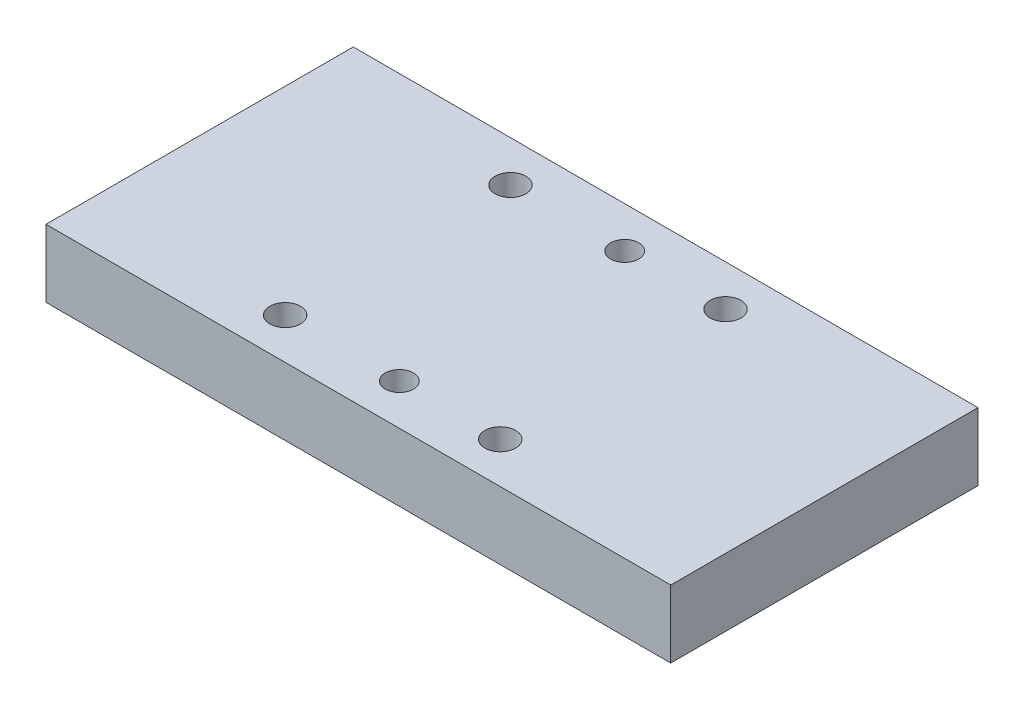
ISO-10303-21;
HEADER;
FILE_DESCRIPTION(('STEP AP214'),'2;1');
FILE_NAME('part.step','',(''),(''),'','','');
FILE_SCHEMA(('AUTOMOTIVE_DESIGN { 1 0 10303 214 1 1 1 1 }'));
ENDSEC;
DATA;
#1=APPLICATION_CONTEXT('core data for automotive mechanical design processes');
#2=APPLICATION_PROTOCOL_DEFINITION('international standard','automotive_design',2000,#1);
#3=PRODUCT_CONTEXT('',#1,'mechanical');
#4=PRODUCT('Part','Part','',(#3));
#5=PRODUCT_RELATED_PRODUCT_CATEGORY('part','',(#4));
#6=PRODUCT_DEFINITION_FORMATION('','',#4);
#7=PRODUCT_DEFINITION_CONTEXT('part definition',#1,'design');
#8=PRODUCT_DEFINITION('design','',#6,#7);
#9=PRODUCT_DEFINITION_SHAPE('','',#8);
#10=(LENGTH_UNIT() NAMED_UNIT(*) SI_UNIT(.MILLI.,.METRE.));
#11=(NAMED_UNIT(*) PLANE_ANGLE_UNIT() SI_UNIT($,.RADIAN.));
#12=(NAMED_UNIT(*) SI_UNIT($,.STERADIAN.) SOLID_ANGLE_UNIT());
#13=UNCERTAINTY_MEASURE_WITH_UNIT(LENGTH_MEASURE(1.E-05),#10,'distance_accuracy_value','');
#14=(GEOMETRIC_REPRESENTATION_CONTEXT(3) GLOBAL_UNCERTAINTY_ASSIGNED_CONTEXT((#13)) GLOBAL_UNIT_ASSIGNED_CONTEXT((#10,
#11,#12)) REPRESENTATION_CONTEXT('',''));
#15=CARTESIAN_POINT('',(0.,0.,0.));
#16=DIRECTION('',(0.,0.,1.));
#17=DIRECTION('',(1.,0.,0.));
#18=AXIS2_PLACEMENT_3D('',#15,#16,#17);
#19=CARTESIAN_POINT('',(0.,13.2,0.));
#20=DIRECTION('',(0.,1.,0.));
#21=DIRECTION('',(0.,0.,1.));
#22=AXIS2_PLACEMENT_3D('',#19,#20,#21);
#23=PLANE('',#22);
#24=CARTESIAN_POINT('',(0.,13.2,22.));
#25=DIRECTION('',(0.,1.,0.));
#26=DIRECTION('',(0.,0.,1.));
#27=AXIS2_PLACEMENT_3D('',#24,#25,#26);
#28=CIRCLE('',#27,2.75);
#29=CARTESIAN_POINT('',(0.,13.2,24.75));
#30=VERTEX_POINT('',#29);
#31=EDGE_CURVE('E162',#30,#30,#28,.T.);
#32=ORIENTED_EDGE('',*,*,#31,.F.);
#33=EDGE_LOOP('',(#32));
#34=FACE_BOUND('',#33,.T.);
#35=CARTESIAN_POINT('',(-22.3018867924528,13.2,22.));
#36=DIRECTION('',(0.,1.,0.));
#37=DIRECTION('',(0.,0.,1.));
#38=AXIS2_PLACEMENT_3D('',#35,#36,#37);
#39=CIRCLE('',#38,3.);
#40=CARTESIAN_POINT('',(-22.3018867924528,13.2,25.));
#41=VERTEX_POINT('',#40);
#42=EDGE_CURVE('E146',#41,#41,#39,.T.);
#43=ORIENTED_EDGE('',*,*,#42,.F.);
#44=EDGE_LOOP('',(#43));
#45=FACE_BOUND('',#44,.T.);
#46=CARTESIAN_POINT('',(19.6981132075472,13.2,-22.));
#47=DIRECTION('',(0.,1.,0.));
#48=DIRECTION('',(0.,0.,1.));
#49=AXIS2_PLACEMENT_3D('',#46,#47,#48);
#50=CIRCLE('',#49,3.);
#51=CARTESIAN_POINT('',(19.6981132075472,13.2,-19.));
#52=VERTEX_POINT('',#51);
#53=EDGE_CURVE('E116',#52,#52,#50,.T.);
#54=ORIENTED_EDGE('',*,*,#53,.F.);
#55=EDGE_LOOP('',(#54));
#56=FACE_BOUND('',#55,.T.);
#57=DIRECTION('',(0.,0.,1.));
#58=VECTOR('',#57,1.);
#59=CARTESIAN_POINT('',(-61.,13.2,30.));
#60=LINE('',#59,#58);
#61=CARTESIAN_POINT('',(-61.,13.2,-30.));
#62=VERTEX_POINT('',#61);
#63=CARTESIAN_POINT('',(-61.,13.2,30.));
#64=VERTEX_POINT('',#63);
#65=EDGE_CURVE('E96',#62,#64,#60,.T.);
#66=ORIENTED_EDGE('',*,*,#65,.T.);
#67=DIRECTION('',(1.,0.,0.));
#68=VECTOR('',#67,1.);
#69=CARTESIAN_POINT('',(61.,13.2,30.));
#70=LINE('',#69,#68);
#71=CARTESIAN_POINT('',(61.,13.2,30.));
#72=VERTEX_POINT('',#71);
#73=EDGE_CURVE('E91',#64,#72,#70,.T.);
#74=ORIENTED_EDGE('',*,*,#73,.T.);
#75=DIRECTION('',(0.,0.,-1.));
#76=VECTOR('',#75,1.);
#77=CARTESIAN_POINT('',(61.,13.2,30.));
#78=LINE('',#77,#76);
#79=CARTESIAN_POINT('',(61.,13.2,-30.));
#80=VERTEX_POINT('',#79);
#81=EDGE_CURVE('E94',#72,#80,#78,.T.);
#82=ORIENTED_EDGE('',*,*,#81,.T.);
#83=DIRECTION('',(-1.,0.,0.));
#84=VECTOR('',#83,1.);
#85=CARTESIAN_POINT('',(61.,13.2,-30.));
#86=LINE('',#85,#84);
#87=EDGE_CURVE('E61',#80,#62,#86,.T.);
#88=ORIENTED_EDGE('',*,*,#87,.T.);
#89=EDGE_LOOP('',(#66,#74,#82,#88));
#90=FACE_BOUND('',#89,.T.);
#91=CARTESIAN_POINT('',(-22.3018867924528,13.2,-22.));
#92=DIRECTION('',(0.,1.,0.));
#93=DIRECTION('',(0.,0.,1.));
#94=AXIS2_PLACEMENT_3D('',#91,#92,#93);
#95=CIRCLE('',#94,3.);
#96=CARTESIAN_POINT('',(-22.3018867924528,13.2,-19.));
#97=VERTEX_POINT('',#96);
#98=EDGE_CURVE('E138',#97,#97,#95,.T.);
#99=ORIENTED_EDGE('',*,*,#98,.F.);
#100=EDGE_LOOP('',(#99));
#101=FACE_BOUND('',#100,.T.);
#102=CARTESIAN_POINT('',(19.6981132075472,13.2,22.));
#103=DIRECTION('',(0.,1.,0.));
#104=DIRECTION('',(0.,0.,1.));
#105=AXIS2_PLACEMENT_3D('',#102,#103,#104);
#106=CIRCLE('',#105,3.);
#107=CARTESIAN_POINT('',(19.6981132075472,13.2,25.));
#108=VERTEX_POINT('',#107);
#109=EDGE_CURVE('E154',#108,#108,#106,.T.);
#110=ORIENTED_EDGE('',*,*,#109,.F.);
#111=EDGE_LOOP('',(#110));
#112=FACE_BOUND('',#111,.T.);
#113=CARTESIAN_POINT('',(0.,13.2,-22.));
#114=DIRECTION('',(0.,1.,0.));
#115=DIRECTION('',(0.,0.,1.));
#116=AXIS2_PLACEMENT_3D('',#113,#114,#115);
#117=CIRCLE('',#116,2.75);
#118=CARTESIAN_POINT('',(0.,13.2,-19.25));
#119=VERTEX_POINT('',#118);
#120=EDGE_CURVE('E170',#119,#119,#117,.T.);
#121=ORIENTED_EDGE('',*,*,#120,.F.);
#122=EDGE_LOOP('',(#121));
#123=FACE_BOUND('',#122,.T.);
#124=ADVANCED_FACE('F43',(#34,#45,#56,#90,#101,#112,#123),#23,.T.);
#125=CARTESIAN_POINT('',(0.,0.,0.));
#126=DIRECTION('',(0.,1.,0.));
#127=DIRECTION('',(0.,0.,1.));
#128=AXIS2_PLACEMENT_3D('',#125,#126,#127);
#129=PLANE('',#128);
#130=DIRECTION('',(0.,0.,1.));
#131=VECTOR('',#130,1.);
#132=CARTESIAN_POINT('',(-61.,0.,30.));
#133=LINE('',#132,#131);
#134=CARTESIAN_POINT('',(-61.,0.,-30.));
#135=VERTEX_POINT('',#134);
#136=CARTESIAN_POINT('',(-61.,0.,30.));
#137=VERTEX_POINT('',#136);
#138=EDGE_CURVE('E112',#135,#137,#133,.T.);
#139=ORIENTED_EDGE('',*,*,#138,.F.);
#140=DIRECTION('',(-1.,0.,0.));
#141=VECTOR('',#140,1.);
#142=CARTESIAN_POINT('',(61.,0.,-30.));
#143=LINE('',#142,#141);
#144=CARTESIAN_POINT('',(61.,0.,-30.));
#145=VERTEX_POINT('',#144);
#146=EDGE_CURVE('E84',#145,#135,#143,.T.);
#147=ORIENTED_EDGE('',*,*,#146,.F.);
#148=DIRECTION('',(0.,0.,-1.));
#149=VECTOR('',#148,1.);
#150=CARTESIAN_POINT('',(61.,0.,30.));
#151=LINE('',#150,#149);
#152=CARTESIAN_POINT('',(61.,0.,30.));
#153=VERTEX_POINT('',#152);
#154=EDGE_CURVE('E78',#153,#145,#151,.T.);
#155=ORIENTED_EDGE('',*,*,#154,.F.);
#156=DIRECTION('',(1.,0.,0.));
#157=VECTOR('',#156,1.);
#158=CARTESIAN_POINT('',(61.,0.,30.));
#159=LINE('',#158,#157);
#160=EDGE_CURVE('E101',#137,#153,#159,.T.);
#161=ORIENTED_EDGE('',*,*,#160,.F.);
#162=EDGE_LOOP('',(#139,#147,#155,#161));
#163=FACE_BOUND('',#162,.T.);
#164=CARTESIAN_POINT('',(19.6981132075472,0.,-22.));
#165=DIRECTION('',(0.,1.,0.));
#166=DIRECTION('',(0.,0.,1.));
#167=AXIS2_PLACEMENT_3D('',#164,#165,#166);
#168=CIRCLE('',#167,3.);
#169=CARTESIAN_POINT('',(19.6981132075472,0.,-19.));
#170=VERTEX_POINT('',#169);
#171=EDGE_CURVE('E134',#170,#170,#168,.T.);
#172=ORIENTED_EDGE('',*,*,#171,.T.);
#173=EDGE_LOOP('',(#172));
#174=FACE_BOUND('',#173,.T.);
#175=CARTESIAN_POINT('',(-22.3018867924528,0.,-22.));
#176=DIRECTION('',(0.,1.,0.));
#177=DIRECTION('',(0.,0.,1.));
#178=AXIS2_PLACEMENT_3D('',#175,#176,#177);
#179=CIRCLE('',#178,3.);
#180=CARTESIAN_POINT('',(-22.3018867924528,0.,-19.));
#181=VERTEX_POINT('',#180);
#182=EDGE_CURVE('E142',#181,#181,#179,.T.);
#183=ORIENTED_EDGE('',*,*,#182,.T.);
#184=EDGE_LOOP('',(#183));
#185=FACE_BOUND('',#184,.T.);
#186=CARTESIAN_POINT('',(-22.3018867924528,0.,22.));
#187=DIRECTION('',(0.,1.,0.));
#188=DIRECTION('',(0.,0.,1.));
#189=AXIS2_PLACEMENT_3D('',#186,#187,#188);
#190=CIRCLE('',#189,3.);
#191=CARTESIAN_POINT('',(-22.3018867924528,0.,25.));
#192=VERTEX_POINT('',#191);
#193=EDGE_CURVE('E150',#192,#192,#190,.T.);
#194=ORIENTED_EDGE('',*,*,#193,.T.);
#195=EDGE_LOOP('',(#194));
#196=FACE_BOUND('',#195,.T.);
#197=CARTESIAN_POINT('',(19.6981132075472,0.,22.));
#198=DIRECTION('',(0.,1.,0.));
#199=DIRECTION('',(0.,0.,1.));
#200=AXIS2_PLACEMENT_3D('',#197,#198,#199);
#201=CIRCLE('',#200,3.);
#202=CARTESIAN_POINT('',(19.6981132075472,0.,25.));
#203=VERTEX_POINT('',#202);
#204=EDGE_CURVE('E158',#203,#203,#201,.T.);
#205=ORIENTED_EDGE('',*,*,#204,.T.);
#206=EDGE_LOOP('',(#205));
#207=FACE_BOUND('',#206,.T.);
#208=CARTESIAN_POINT('',(0.,0.,22.));
#209=DIRECTION('',(0.,1.,0.));
#210=DIRECTION('',(0.,0.,1.));
#211=AXIS2_PLACEMENT_3D('',#208,#209,#210);
#212=CIRCLE('',#211,2.75);
#213=CARTESIAN_POINT('',(0.,0.,24.75));
#214=VERTEX_POINT('',#213);
#215=EDGE_CURVE('E166',#214,#214,#212,.T.);
#216=ORIENTED_EDGE('',*,*,#215,.T.);
#217=EDGE_LOOP('',(#216));
#218=FACE_BOUND('',#217,.T.);
#219=CARTESIAN_POINT('',(0.,0.,-22.));
#220=DIRECTION('',(0.,1.,0.));
#221=DIRECTION('',(0.,0.,1.));
#222=AXIS2_PLACEMENT_3D('',#219,#220,#221);
#223=CIRCLE('',#222,2.75);
#224=CARTESIAN_POINT('',(0.,0.,-19.25));
#225=VERTEX_POINT('',#224);
#226=EDGE_CURVE('E174',#225,#225,#223,.T.);
#227=ORIENTED_EDGE('',*,*,#226,.T.);
#228=EDGE_LOOP('',(#227));
#229=FACE_BOUND('',#228,.T.);
#230=ADVANCED_FACE('F129',(#163,#174,#185,#196,#207,#218,#229),#129,.F.);
#231=CARTESIAN_POINT('',(-61.,13.2,30.));
#232=DIRECTION('',(1.,0.,0.));
#233=DIRECTION('',(0.,0.,-1.));
#234=AXIS2_PLACEMENT_3D('',#231,#232,#233);
#235=PLANE('',#234);
#236=ORIENTED_EDGE('',*,*,#138,.T.);
#237=DIRECTION('',(0.,-1.,0.));
#238=VECTOR('',#237,1.);
#239=CARTESIAN_POINT('',(-61.,13.2,30.));
#240=LINE('',#239,#238);
#241=EDGE_CURVE('E11',#64,#137,#240,.T.);
#242=ORIENTED_EDGE('',*,*,#241,.F.);
#243=ORIENTED_EDGE('',*,*,#65,.F.);
#244=DIRECTION('',(0.,-1.,0.));
#245=VECTOR('',#244,1.);
#246=CARTESIAN_POINT('',(-61.,13.2,-30.));
#247=LINE('',#246,#245);
#248=EDGE_CURVE('E108',#62,#135,#247,.T.);
#249=ORIENTED_EDGE('',*,*,#248,.T.);
#250=EDGE_LOOP('',(#236,#242,#243,#249));
#251=FACE_BOUND('',#250,.T.);
#252=ADVANCED_FACE('F45',(#251),#235,.F.);
#253=CARTESIAN_POINT('',(61.,13.2,30.));
#254=DIRECTION('',(0.,0.,-1.));
#255=DIRECTION('',(-1.,0.,0.));
#256=AXIS2_PLACEMENT_3D('',#253,#254,#255);
#257=PLANE('',#256);
#258=ORIENTED_EDGE('',*,*,#160,.T.);
#259=DIRECTION('',(0.,-1.,0.));
#260=VECTOR('',#259,1.);
#261=CARTESIAN_POINT('',(61.,13.2,30.));
#262=LINE('',#261,#260);
#263=EDGE_CURVE('E53',#72,#153,#262,.T.);
#264=ORIENTED_EDGE('',*,*,#263,.F.);
#265=ORIENTED_EDGE('',*,*,#73,.F.);
#266=ORIENTED_EDGE('',*,*,#241,.T.);
#267=EDGE_LOOP('',(#258,#264,#265,#266));
#268=FACE_BOUND('',#267,.T.);
#269=ADVANCED_FACE('F100',(#268),#257,.F.);
#270=CARTESIAN_POINT('',(61.,13.2,30.));
#271=DIRECTION('',(-1.,0.,0.));
#272=DIRECTION('',(0.,0.,1.));
#273=AXIS2_PLACEMENT_3D('',#270,#271,#272);
#274=PLANE('',#273);
#275=ORIENTED_EDGE('',*,*,#154,.T.);
#276=DIRECTION('',(0.,-1.,0.));
#277=VECTOR('',#276,1.);
#278=CARTESIAN_POINT('',(61.,13.2,-30.));
#279=LINE('',#278,#277);
#280=EDGE_CURVE('E103',#80,#145,#279,.T.);
#281=ORIENTED_EDGE('',*,*,#280,.F.);
#282=ORIENTED_EDGE('',*,*,#81,.F.);
#283=ORIENTED_EDGE('',*,*,#263,.T.);
#284=EDGE_LOOP('',(#275,#281,#282,#283));
#285=FACE_BOUND('',#284,.T.);
#286=ADVANCED_FACE('F104',(#285),#274,.F.);
#287=CARTESIAN_POINT('',(61.,13.2,-30.));
#288=DIRECTION('',(0.,0.,1.));
#289=DIRECTION('',(1.,0.,0.));
#290=AXIS2_PLACEMENT_3D('',#287,#288,#289);
#291=PLANE('',#290);
#292=ORIENTED_EDGE('',*,*,#146,.T.);
#293=ORIENTED_EDGE('',*,*,#248,.F.);
#294=ORIENTED_EDGE('',*,*,#87,.F.);
#295=ORIENTED_EDGE('',*,*,#280,.T.);
#296=EDGE_LOOP('',(#292,#293,#294,#295));
#297=FACE_BOUND('',#296,.T.);
#298=ADVANCED_FACE('F126',(#297),#291,.F.);
#299=CARTESIAN_POINT('',(19.6981132075472,13.2,-22.));
#300=DIRECTION('',(0.,-1.,0.));
#301=DIRECTION('',(0.,0.,-1.));
#302=AXIS2_PLACEMENT_3D('',#299,#300,#301);
#303=CYLINDRICAL_SURFACE('',#302,3.);
#304=ORIENTED_EDGE('',*,*,#53,.T.);
#305=EDGE_LOOP('',(#304));
#306=FACE_BOUND('',#305,.T.);
#307=ORIENTED_EDGE('',*,*,#171,.F.);
#308=EDGE_LOOP('',(#307));
#309=FACE_BOUND('',#308,.T.);
#310=ADVANCED_FACE('F195',(#306,#309),#303,.F.);
#311=CARTESIAN_POINT('',(-22.3018867924528,13.2,-22.));
#312=DIRECTION('',(0.,-1.,0.));
#313=DIRECTION('',(0.,0.,-1.));
#314=AXIS2_PLACEMENT_3D('',#311,#312,#313);
#315=CYLINDRICAL_SURFACE('',#314,3.);
#316=ORIENTED_EDGE('',*,*,#98,.T.);
#317=EDGE_LOOP('',(#316));
#318=FACE_BOUND('',#317,.T.);
#319=ORIENTED_EDGE('',*,*,#182,.F.);
#320=EDGE_LOOP('',(#319));
#321=FACE_BOUND('',#320,.T.);
#322=ADVANCED_FACE('F249',(#318,#321),#315,.F.);
#323=CARTESIAN_POINT('',(-22.3018867924528,13.2,22.));
#324=DIRECTION('',(0.,-1.,0.));
#325=DIRECTION('',(0.,0.,-1.));
#326=AXIS2_PLACEMENT_3D('',#323,#324,#325);
#327=CYLINDRICAL_SURFACE('',#326,3.);
#328=ORIENTED_EDGE('',*,*,#42,.T.);
#329=EDGE_LOOP('',(#328));
#330=FACE_BOUND('',#329,.T.);
#331=ORIENTED_EDGE('',*,*,#193,.F.);
#332=EDGE_LOOP('',(#331));
#333=FACE_BOUND('',#332,.T.);
#334=ADVANCED_FACE('F258',(#330,#333),#327,.F.);
#335=CARTESIAN_POINT('',(19.6981132075472,13.2,22.));
#336=DIRECTION('',(0.,-1.,0.));
#337=DIRECTION('',(0.,0.,-1.));
#338=AXIS2_PLACEMENT_3D('',#335,#336,#337);
#339=CYLINDRICAL_SURFACE('',#338,3.);
#340=ORIENTED_EDGE('',*,*,#109,.T.);
#341=EDGE_LOOP('',(#340));
#342=FACE_BOUND('',#341,.T.);
#343=ORIENTED_EDGE('',*,*,#204,.F.);
#344=EDGE_LOOP('',(#343));
#345=FACE_BOUND('',#344,.T.);
#346=ADVANCED_FACE('F267',(#342,#345),#339,.F.);
#347=CARTESIAN_POINT('',(0.,13.2,22.));
#348=DIRECTION('',(0.,-1.,0.));
#349=DIRECTION('',(0.,0.,-1.));
#350=AXIS2_PLACEMENT_3D('',#347,#348,#349);
#351=CYLINDRICAL_SURFACE('',#350,2.75);
#352=ORIENTED_EDGE('',*,*,#31,.T.);
#353=EDGE_LOOP('',(#352));
#354=FACE_BOUND('',#353,.T.);
#355=ORIENTED_EDGE('',*,*,#215,.F.);
#356=EDGE_LOOP('',(#355));
#357=FACE_BOUND('',#356,.T.);
#358=ADVANCED_FACE('F277',(#354,#357),#351,.F.);
#359=CARTESIAN_POINT('',(0.,13.2,-22.));
#360=DIRECTION('',(0.,-1.,0.));
#361=DIRECTION('',(0.,0.,-1.));
#362=AXIS2_PLACEMENT_3D('',#359,#360,#361);
#363=CYLINDRICAL_SURFACE('',#362,2.75);
#364=ORIENTED_EDGE('',*,*,#120,.T.);
#365=EDGE_LOOP('',(#364));
#366=FACE_BOUND('',#365,.T.);
#367=ORIENTED_EDGE('',*,*,#226,.F.);
#368=EDGE_LOOP('',(#367));
#369=FACE_BOUND('',#368,.T.);
#370=ADVANCED_FACE('F182',(#366,#369),#363,.F.);
#371=CLOSED_SHELL('',(#124,#230,#252,#269,#286,#298,#310,#322,#334,#346,#358,#370));
#372=MANIFOLD_SOLID_BREP('B2',#371);
#373=ADVANCED_BREP_SHAPE_REPRESENTATION('',(#18,#372),#14);
#374=SHAPE_DEFINITION_REPRESENTATION(#9,#373);
ENDSEC;
END-ISO-10303-21;
